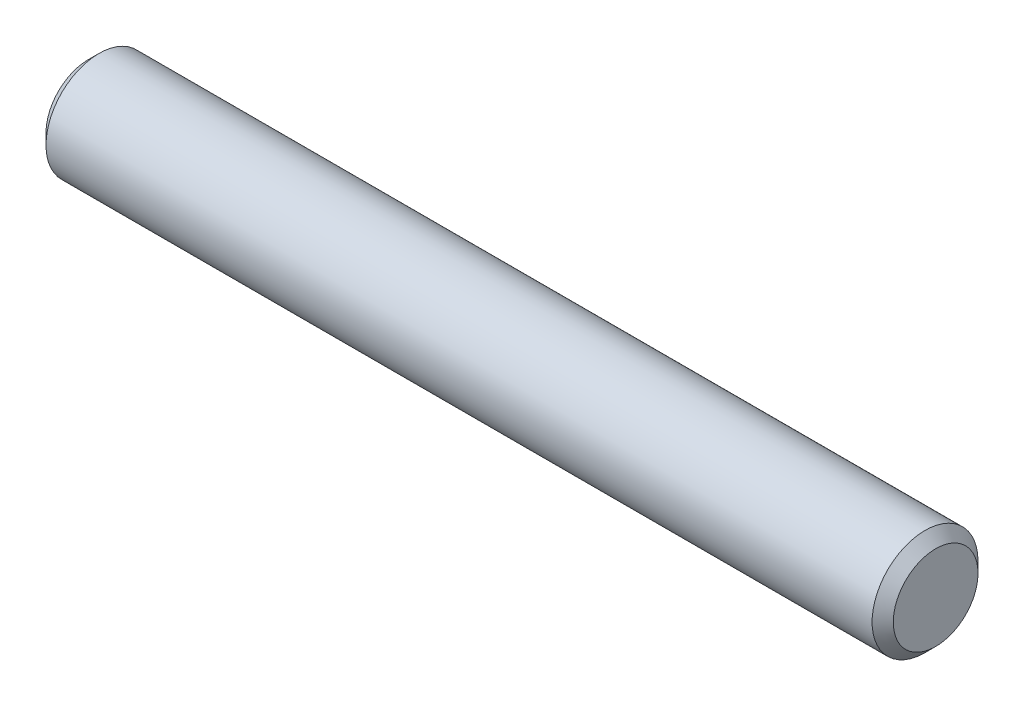
ISO-10303-21;
HEADER;
FILE_DESCRIPTION(('STEP AP214'),'2;1');
FILE_NAME('part.step','',(''),(''),'','','');
FILE_SCHEMA(('AUTOMOTIVE_DESIGN { 1 0 10303 214 1 1 1 1 }'));
ENDSEC;
DATA;
#1=APPLICATION_CONTEXT('core data for automotive mechanical design processes');
#2=APPLICATION_PROTOCOL_DEFINITION('international standard','automotive_design',2000,#1);
#3=PRODUCT_CONTEXT('',#1,'mechanical');
#4=PRODUCT('Part','Part','',(#3));
#5=PRODUCT_RELATED_PRODUCT_CATEGORY('part','',(#4));
#6=PRODUCT_DEFINITION_FORMATION('','',#4);
#7=PRODUCT_DEFINITION_CONTEXT('part definition',#1,'design');
#8=PRODUCT_DEFINITION('design','',#6,#7);
#9=PRODUCT_DEFINITION_SHAPE('','',#8);
#10=(LENGTH_UNIT() NAMED_UNIT(*) SI_UNIT(.MILLI.,.METRE.));
#11=(NAMED_UNIT(*) PLANE_ANGLE_UNIT() SI_UNIT($,.RADIAN.));
#12=(NAMED_UNIT(*) SI_UNIT($,.STERADIAN.) SOLID_ANGLE_UNIT());
#13=UNCERTAINTY_MEASURE_WITH_UNIT(LENGTH_MEASURE(1.E-05),#10,'distance_accuracy_value','');
#14=(GEOMETRIC_REPRESENTATION_CONTEXT(3) GLOBAL_UNCERTAINTY_ASSIGNED_CONTEXT((#13)) GLOBAL_UNIT_ASSIGNED_CONTEXT((#10,
#11,#12)) REPRESENTATION_CONTEXT('',''));
#15=CARTESIAN_POINT('',(0.,0.,0.));
#16=DIRECTION('',(0.,0.,1.));
#17=DIRECTION('',(1.,0.,0.));
#18=AXIS2_PLACEMENT_3D('',#15,#16,#17);
#19=CARTESIAN_POINT('',(-25.4,0.,0.));
#20=DIRECTION('',(1.,0.,0.));
#21=DIRECTION('',(0.,0.,-1.));
#22=AXIS2_PLACEMENT_3D('',#19,#20,#21);
#23=CYLINDRICAL_SURFACE('',#22,3.175);
#24=CARTESIAN_POINT('',(24.765,0.,0.));
#25=DIRECTION('',(1.,0.,0.));
#26=DIRECTION('',(0.,0.,-1.));
#27=AXIS2_PLACEMENT_3D('',#24,#25,#26);
#28=CIRCLE('',#27,3.175);
#29=CARTESIAN_POINT('',(24.765,0.,-3.175));
#30=VERTEX_POINT('',#29);
#31=EDGE_CURVE('E36',#30,#30,#28,.F.);
#32=ORIENTED_EDGE('',*,*,#31,.T.);
#33=EDGE_LOOP('',(#32));
#34=FACE_BOUND('',#33,.T.);
#35=CARTESIAN_POINT('',(-24.765,0.,0.));
#36=DIRECTION('',(1.,0.,0.));
#37=DIRECTION('',(0.,0.,-1.));
#38=AXIS2_PLACEMENT_3D('',#35,#36,#37);
#39=CIRCLE('',#38,3.175);
#40=CARTESIAN_POINT('',(-24.765,0.,-3.175));
#41=VERTEX_POINT('',#40);
#42=EDGE_CURVE('E40',#41,#41,#39,.T.);
#43=ORIENTED_EDGE('',*,*,#42,.T.);
#44=EDGE_LOOP('',(#43));
#45=FACE_BOUND('',#44,.T.);
#46=ADVANCED_FACE('F29',(#34,#45),#23,.T.);
#47=CARTESIAN_POINT('',(-25.4,0.,0.));
#48=DIRECTION('',(1.,0.,0.));
#49=DIRECTION('',(0.,0.,-1.));
#50=AXIS2_PLACEMENT_3D('',#47,#48,#49);
#51=PLANE('',#50);
#52=CARTESIAN_POINT('',(-25.4,0.,0.));
#53=DIRECTION('',(1.,0.,0.));
#54=DIRECTION('',(0.,0.,-1.));
#55=AXIS2_PLACEMENT_3D('',#52,#53,#54);
#56=CIRCLE('',#55,2.53999999999999);
#57=CARTESIAN_POINT('',(-25.4,0.,-2.53999999999999));
#58=VERTEX_POINT('',#57);
#59=EDGE_CURVE('E10',#58,#58,#56,.F.);
#60=ORIENTED_EDGE('',*,*,#59,.T.);
#61=EDGE_LOOP('',(#60));
#62=FACE_BOUND('',#61,.T.);
#63=ADVANCED_FACE('F60',(#62),#51,.F.);
#64=CARTESIAN_POINT('',(25.4,0.,0.));
#65=DIRECTION('',(1.,0.,0.));
#66=DIRECTION('',(0.,0.,-1.));
#67=AXIS2_PLACEMENT_3D('',#64,#65,#66);
#68=PLANE('',#67);
#69=CARTESIAN_POINT('',(25.4,0.,0.));
#70=DIRECTION('',(1.,0.,0.));
#71=DIRECTION('',(0.,0.,-1.));
#72=AXIS2_PLACEMENT_3D('',#69,#70,#71);
#73=CIRCLE('',#72,2.54);
#74=CARTESIAN_POINT('',(25.4,0.,-2.54));
#75=VERTEX_POINT('',#74);
#76=EDGE_CURVE('E44',#75,#75,#73,.T.);
#77=ORIENTED_EDGE('',*,*,#76,.T.);
#78=EDGE_LOOP('',(#77));
#79=FACE_BOUND('',#78,.T.);
#80=ADVANCED_FACE('F50',(#79),#68,.T.);
#81=CARTESIAN_POINT('',(25.4,0.,0.));
#82=DIRECTION('',(-1.,0.,0.));
#83=DIRECTION('',(0.,0.,1.));
#84=AXIS2_PLACEMENT_3D('',#81,#82,#83);
#85=CONICAL_SURFACE('',#84,2.54,0.785398163397439);
#86=ORIENTED_EDGE('',*,*,#31,.F.);
#87=EDGE_LOOP('',(#86));
#88=FACE_BOUND('',#87,.T.);
#89=ORIENTED_EDGE('',*,*,#76,.F.);
#90=EDGE_LOOP('',(#89));
#91=FACE_BOUND('',#90,.T.);
#92=ADVANCED_FACE('F52',(#88,#91),#85,.T.);
#93=CARTESIAN_POINT('',(-24.765,0.,0.));
#94=DIRECTION('',(1.,0.,0.));
#95=DIRECTION('',(0.,0.,-1.));
#96=AXIS2_PLACEMENT_3D('',#93,#94,#95);
#97=CONICAL_SURFACE('',#96,3.175,0.78539816339745);
#98=ORIENTED_EDGE('',*,*,#59,.F.);
#99=EDGE_LOOP('',(#98));
#100=FACE_BOUND('',#99,.T.);
#101=ORIENTED_EDGE('',*,*,#42,.F.);
#102=EDGE_LOOP('',(#101));
#103=FACE_BOUND('',#102,.T.);
#104=ADVANCED_FACE('F31',(#100,#103),#97,.T.);
#105=CLOSED_SHELL('',(#46,#63,#80,#92,#104));
#106=MANIFOLD_SOLID_BREP('B2',#105);
#107=ADVANCED_BREP_SHAPE_REPRESENTATION('',(#18,#106),#14);
#108=SHAPE_DEFINITION_REPRESENTATION(#9,#107);
ENDSEC;
END-ISO-10303-21;
